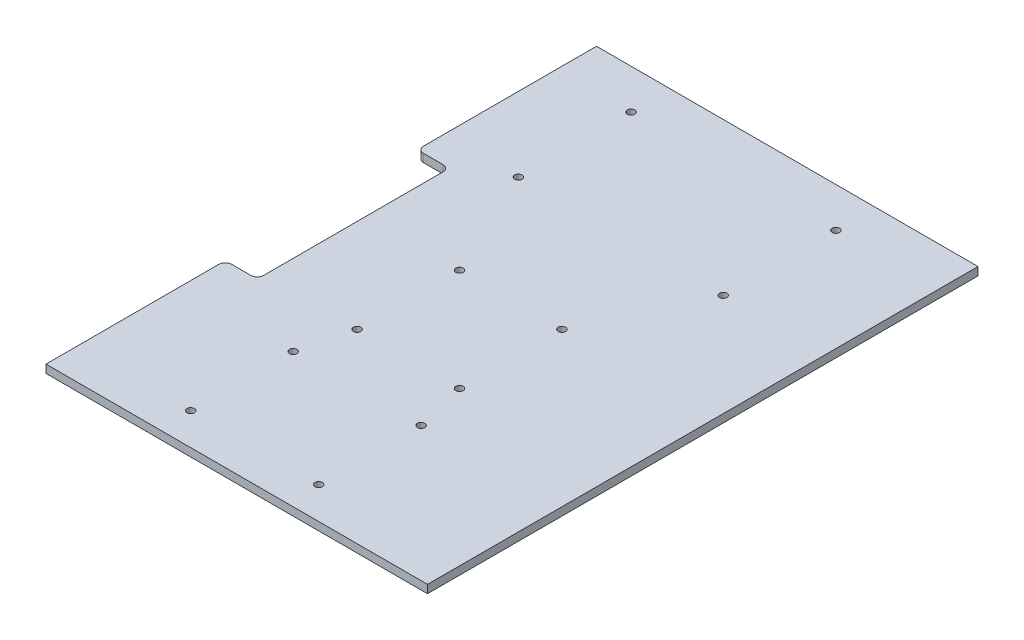
ISO-10303-21;
HEADER;
FILE_DESCRIPTION(('STEP AP214'),'2;1');
FILE_NAME('part.step','',(''),(''),'','','');
FILE_SCHEMA(('AUTOMOTIVE_DESIGN { 1 0 10303 214 1 1 1 1 }'));
ENDSEC;
DATA;
#1=APPLICATION_CONTEXT('core data for automotive mechanical design processes');
#2=APPLICATION_PROTOCOL_DEFINITION('international standard','automotive_design',2000,#1);
#3=PRODUCT_CONTEXT('',#1,'mechanical');
#4=PRODUCT('Part','Part','',(#3));
#5=PRODUCT_RELATED_PRODUCT_CATEGORY('part','',(#4));
#6=PRODUCT_DEFINITION_FORMATION('','',#4);
#7=PRODUCT_DEFINITION_CONTEXT('part definition',#1,'design');
#8=PRODUCT_DEFINITION('design','',#6,#7);
#9=PRODUCT_DEFINITION_SHAPE('','',#8);
#10=(LENGTH_UNIT() NAMED_UNIT(*) SI_UNIT(.MILLI.,.METRE.));
#11=(NAMED_UNIT(*) PLANE_ANGLE_UNIT() SI_UNIT($,.RADIAN.));
#12=(NAMED_UNIT(*) SI_UNIT($,.STERADIAN.) SOLID_ANGLE_UNIT());
#13=UNCERTAINTY_MEASURE_WITH_UNIT(LENGTH_MEASURE(1.E-05),#10,'distance_accuracy_value','');
#14=(GEOMETRIC_REPRESENTATION_CONTEXT(3) GLOBAL_UNCERTAINTY_ASSIGNED_CONTEXT((#13)) GLOBAL_UNIT_ASSIGNED_CONTEXT((#10,
#11,#12)) REPRESENTATION_CONTEXT('',''));
#15=CARTESIAN_POINT('',(0.,0.,0.));
#16=DIRECTION('',(0.,0.,1.));
#17=DIRECTION('',(1.,0.,0.));
#18=AXIS2_PLACEMENT_3D('',#15,#16,#17);
#19=CARTESIAN_POINT('',(-160.,0.,-215.));
#20=DIRECTION('',(0.,0.,1.));
#21=DIRECTION('',(-1.,0.,0.));
#22=AXIS2_PLACEMENT_3D('',#19,#20,#21);
#23=PLANE('',#22);
#24=DIRECTION('',(0.,1.,0.));
#25=VECTOR('',#24,1.);
#26=CARTESIAN_POINT('',(-138.,0.,-215.));
#27=LINE('',#26,#25);
#28=CARTESIAN_POINT('',(-138.,0.,-215.));
#29=VERTEX_POINT('',#28);
#30=CARTESIAN_POINT('',(-138.,6.35,-215.));
#31=VERTEX_POINT('',#30);
#32=EDGE_CURVE('E144',#29,#31,#27,.T.);
#33=ORIENTED_EDGE('',*,*,#32,.T.);
#34=DIRECTION('',(1.,0.,0.));
#35=VECTOR('',#34,1.);
#36=CARTESIAN_POINT('',(0.,6.35,-215.));
#37=LINE('',#36,#35);
#38=CARTESIAN_POINT('',(160.,6.35,-215.));
#39=VERTEX_POINT('',#38);
#40=EDGE_CURVE('E158',#39,#31,#37,.F.);
#41=ORIENTED_EDGE('',*,*,#40,.F.);
#42=DIRECTION('',(0.,-1.,0.));
#43=VECTOR('',#42,1.);
#44=CARTESIAN_POINT('',(160.,0.,-215.));
#45=LINE('',#44,#43);
#46=CARTESIAN_POINT('',(160.,0.,-215.));
#47=VERTEX_POINT('',#46);
#48=EDGE_CURVE('E167',#39,#47,#45,.T.);
#49=ORIENTED_EDGE('',*,*,#48,.T.);
#50=DIRECTION('',(-1.,0.,0.));
#51=VECTOR('',#50,1.);
#52=CARTESIAN_POINT('',(-160.,0.,-215.));
#53=LINE('',#52,#51);
#54=EDGE_CURVE('E153',#47,#29,#53,.T.);
#55=ORIENTED_EDGE('',*,*,#54,.T.);
#56=EDGE_LOOP('',(#33,#41,#49,#55));
#57=FACE_BOUND('',#56,.T.);
#58=ADVANCED_FACE('F36',(#57),#23,.F.);
#59=CARTESIAN_POINT('',(160.,0.,215.));
#60=DIRECTION('',(-1.,0.,0.));
#61=DIRECTION('',(0.,0.,-1.));
#62=AXIS2_PLACEMENT_3D('',#59,#60,#61);
#63=PLANE('',#62);
#64=ORIENTED_EDGE('',*,*,#48,.F.);
#65=DIRECTION('',(0.,0.,-1.));
#66=VECTOR('',#65,1.);
#67=CARTESIAN_POINT('',(160.,6.35,0.));
#68=LINE('',#67,#66);
#69=CARTESIAN_POINT('',(160.,6.35,215.));
#70=VERTEX_POINT('',#69);
#71=EDGE_CURVE('E161',#70,#39,#68,.T.);
#72=ORIENTED_EDGE('',*,*,#71,.F.);
#73=DIRECTION('',(0.,-1.,0.));
#74=VECTOR('',#73,1.);
#75=CARTESIAN_POINT('',(160.,0.,215.));
#76=LINE('',#75,#74);
#77=CARTESIAN_POINT('',(160.,0.,215.));
#78=VERTEX_POINT('',#77);
#79=EDGE_CURVE('E156',#70,#78,#76,.T.);
#80=ORIENTED_EDGE('',*,*,#79,.T.);
#81=DIRECTION('',(0.,0.,-1.));
#82=VECTOR('',#81,1.);
#83=CARTESIAN_POINT('',(160.,0.,215.));
#84=LINE('',#83,#82);
#85=EDGE_CURVE('E152',#78,#47,#84,.T.);
#86=ORIENTED_EDGE('',*,*,#85,.T.);
#87=EDGE_LOOP('',(#64,#72,#80,#86));
#88=FACE_BOUND('',#87,.T.);
#89=ADVANCED_FACE('F241',(#88),#63,.F.);
#90=CARTESIAN_POINT('',(-160.,0.,215.));
#91=DIRECTION('',(0.,0.,-1.));
#92=DIRECTION('',(1.,0.,0.));
#93=AXIS2_PLACEMENT_3D('',#90,#91,#92);
#94=PLANE('',#93);
#95=DIRECTION('',(0.,1.,0.));
#96=VECTOR('',#95,1.);
#97=CARTESIAN_POINT('',(-138.,0.,215.));
#98=LINE('',#97,#96);
#99=CARTESIAN_POINT('',(-138.,0.,215.));
#100=VERTEX_POINT('',#99);
#101=CARTESIAN_POINT('',(-138.,6.35,215.));
#102=VERTEX_POINT('',#101);
#103=EDGE_CURVE('E128',#100,#102,#98,.T.);
#104=ORIENTED_EDGE('',*,*,#103,.F.);
#105=DIRECTION('',(1.,0.,0.));
#106=VECTOR('',#105,1.);
#107=CARTESIAN_POINT('',(-160.,0.,215.));
#108=LINE('',#107,#106);
#109=EDGE_CURVE('E141',#100,#78,#108,.T.);
#110=ORIENTED_EDGE('',*,*,#109,.T.);
#111=ORIENTED_EDGE('',*,*,#79,.F.);
#112=DIRECTION('',(1.,0.,0.));
#113=VECTOR('',#112,1.);
#114=CARTESIAN_POINT('',(0.,6.35,215.));
#115=LINE('',#114,#113);
#116=EDGE_CURVE('E143',#102,#70,#115,.T.);
#117=ORIENTED_EDGE('',*,*,#116,.F.);
#118=EDGE_LOOP('',(#104,#110,#111,#117));
#119=FACE_BOUND('',#118,.T.);
#120=ADVANCED_FACE('F139',(#119),#94,.F.);
#121=CARTESIAN_POINT('',(0.,0.,0.));
#122=DIRECTION('',(0.,-1.,0.));
#123=DIRECTION('',(0.,0.,-1.));
#124=AXIS2_PLACEMENT_3D('',#121,#122,#123);
#125=PLANE('',#124);
#126=CARTESIAN_POINT('',(-79.9999999999998,0.,-95.9999999999997));
#127=DIRECTION('',(0.,1.,0.));
#128=DIRECTION('',(0.,0.,1.));
#129=AXIS2_PLACEMENT_3D('',#126,#127,#128);
#130=CIRCLE('',#129,2.9);
#131=CARTESIAN_POINT('',(-79.9999999999998,0.,-93.0999999999997));
#132=VERTEX_POINT('',#131);
#133=EDGE_CURVE('E344',#132,#132,#130,.T.);
#134=ORIENTED_EDGE('',*,*,#133,.T.);
#135=EDGE_LOOP('',(#134));
#136=FACE_BOUND('',#135,.T.);
#137=CARTESIAN_POINT('',(-80.0000000000002,0.,-184.));
#138=DIRECTION('',(0.,1.,0.));
#139=DIRECTION('',(0.,0.,1.));
#140=AXIS2_PLACEMENT_3D('',#137,#138,#139);
#141=CIRCLE('',#140,2.9);
#142=CARTESIAN_POINT('',(-80.0000000000002,0.,-181.1));
#143=VERTEX_POINT('',#142);
#144=EDGE_CURVE('E354',#143,#143,#141,.T.);
#145=ORIENTED_EDGE('',*,*,#144,.T.);
#146=EDGE_LOOP('',(#145));
#147=FACE_BOUND('',#146,.T.);
#148=CARTESIAN_POINT('',(79.9999999999998,0.,-184.));
#149=DIRECTION('',(0.,1.,0.));
#150=DIRECTION('',(0.,0.,1.));
#151=AXIS2_PLACEMENT_3D('',#148,#149,#150);
#152=CIRCLE('',#151,2.9);
#153=CARTESIAN_POINT('',(79.9999999999998,0.,-181.1));
#154=VERTEX_POINT('',#153);
#155=EDGE_CURVE('E360',#154,#154,#152,.T.);
#156=ORIENTED_EDGE('',*,*,#155,.T.);
#157=EDGE_LOOP('',(#156));
#158=FACE_BOUND('',#157,.T.);
#159=CARTESIAN_POINT('',(80.0000000000002,0.,-96.0000000000003));
#160=DIRECTION('',(0.,1.,0.));
#161=DIRECTION('',(0.,0.,1.));
#162=AXIS2_PLACEMENT_3D('',#159,#160,#161);
#163=CIRCLE('',#162,2.9);
#164=CARTESIAN_POINT('',(80.0000000000002,0.,-93.1000000000003));
#165=VERTEX_POINT('',#164);
#166=EDGE_CURVE('E366',#165,#165,#163,.T.);
#167=ORIENTED_EDGE('',*,*,#166,.T.);
#168=EDGE_LOOP('',(#167));
#169=FACE_BOUND('',#168,.T.);
#170=CARTESIAN_POINT('',(-40.,0.,70.));
#171=DIRECTION('',(0.,1.,0.));
#172=DIRECTION('',(0.,0.,1.));
#173=AXIS2_PLACEMENT_3D('',#170,#171,#172);
#174=CIRCLE('',#173,2.9);
#175=CARTESIAN_POINT('',(-40.,0.,72.9));
#176=VERTEX_POINT('',#175);
#177=EDGE_CURVE('E372',#176,#176,#174,.T.);
#178=ORIENTED_EDGE('',*,*,#177,.T.);
#179=EDGE_LOOP('',(#178));
#180=FACE_BOUND('',#179,.T.);
#181=CARTESIAN_POINT('',(40.,0.,70.));
#182=DIRECTION('',(0.,1.,0.));
#183=DIRECTION('',(0.,0.,1.));
#184=AXIS2_PLACEMENT_3D('',#181,#182,#183);
#185=CIRCLE('',#184,2.9);
#186=CARTESIAN_POINT('',(40.,0.,72.9));
#187=VERTEX_POINT('',#186);
#188=EDGE_CURVE('E378',#187,#187,#185,.T.);
#189=ORIENTED_EDGE('',*,*,#188,.T.);
#190=EDGE_LOOP('',(#189));
#191=FACE_BOUND('',#190,.T.);
#192=CARTESIAN_POINT('',(40.,0.,-9.99999999999999));
#193=DIRECTION('',(0.,1.,0.));
#194=DIRECTION('',(0.,0.,1.));
#195=AXIS2_PLACEMENT_3D('',#192,#193,#194);
#196=CIRCLE('',#195,2.9);
#197=CARTESIAN_POINT('',(40.,0.,-7.09999999999999));
#198=VERTEX_POINT('',#197);
#199=EDGE_CURVE('E384',#198,#198,#196,.T.);
#200=ORIENTED_EDGE('',*,*,#199,.T.);
#201=EDGE_LOOP('',(#200));
#202=FACE_BOUND('',#201,.T.);
#203=CARTESIAN_POINT('',(-40.,0.,-9.99999999999999));
#204=DIRECTION('',(0.,1.,0.));
#205=DIRECTION('',(0.,0.,1.));
#206=AXIS2_PLACEMENT_3D('',#203,#204,#205);
#207=CIRCLE('',#206,2.9);
#208=CARTESIAN_POINT('',(-40.,0.,-7.09999999999999));
#209=VERTEX_POINT('',#208);
#210=EDGE_CURVE('E390',#209,#209,#207,.T.);
#211=ORIENTED_EDGE('',*,*,#210,.T.);
#212=EDGE_LOOP('',(#211));
#213=FACE_BOUND('',#212,.T.);
#214=CARTESIAN_POINT('',(-50.,0.,110.));
#215=DIRECTION('',(0.,1.,0.));
#216=DIRECTION('',(0.,0.,1.));
#217=AXIS2_PLACEMENT_3D('',#214,#215,#216);
#218=CIRCLE('',#217,2.9);
#219=CARTESIAN_POINT('',(-50.,0.,112.9));
#220=VERTEX_POINT('',#219);
#221=EDGE_CURVE('E396',#220,#220,#218,.T.);
#222=ORIENTED_EDGE('',*,*,#221,.T.);
#223=EDGE_LOOP('',(#222));
#224=FACE_BOUND('',#223,.T.);
#225=CARTESIAN_POINT('',(-50.,0.,190.));
#226=DIRECTION('',(0.,1.,0.));
#227=DIRECTION('',(0.,0.,1.));
#228=AXIS2_PLACEMENT_3D('',#225,#226,#227);
#229=CIRCLE('',#228,2.9);
#230=CARTESIAN_POINT('',(-50.,0.,192.9));
#231=VERTEX_POINT('',#230);
#232=EDGE_CURVE('E402',#231,#231,#229,.T.);
#233=ORIENTED_EDGE('',*,*,#232,.T.);
#234=EDGE_LOOP('',(#233));
#235=FACE_BOUND('',#234,.T.);
#236=CARTESIAN_POINT('',(50.,0.,190.));
#237=DIRECTION('',(0.,1.,0.));
#238=DIRECTION('',(0.,0.,1.));
#239=AXIS2_PLACEMENT_3D('',#236,#237,#238);
#240=CIRCLE('',#239,2.9);
#241=CARTESIAN_POINT('',(50.,0.,192.9));
#242=VERTEX_POINT('',#241);
#243=EDGE_CURVE('E408',#242,#242,#240,.T.);
#244=ORIENTED_EDGE('',*,*,#243,.T.);
#245=EDGE_LOOP('',(#244));
#246=FACE_BOUND('',#245,.T.);
#247=CARTESIAN_POINT('',(50.,0.,110.));
#248=DIRECTION('',(0.,1.,0.));
#249=DIRECTION('',(0.,0.,1.));
#250=AXIS2_PLACEMENT_3D('',#247,#248,#249);
#251=CIRCLE('',#250,2.9);
#252=CARTESIAN_POINT('',(50.,0.,112.9));
#253=VERTEX_POINT('',#252);
#254=EDGE_CURVE('E226',#253,#253,#251,.T.);
#255=ORIENTED_EDGE('',*,*,#254,.T.);
#256=EDGE_LOOP('',(#255));
#257=FACE_BOUND('',#256,.T.);
#258=DIRECTION('',(-1.,0.,0.));
#259=VECTOR('',#258,1.);
#260=CARTESIAN_POINT('',(-138.,0.,-75.));
#261=LINE('',#260,#259);
#262=CARTESIAN_POINT('',(-118.,0.,-75.));
#263=VERTEX_POINT('',#262);
#264=CARTESIAN_POINT('',(-133.,0.,-75.));
#265=VERTEX_POINT('',#264);
#266=EDGE_CURVE('E220',#263,#265,#261,.T.);
#267=ORIENTED_EDGE('',*,*,#266,.T.);
#268=CARTESIAN_POINT('',(-133.,0.,-80.));
#269=DIRECTION('',(0.,-1.,0.));
#270=DIRECTION('',(0.,0.,-1.));
#271=AXIS2_PLACEMENT_3D('',#268,#269,#270);
#272=CIRCLE('',#271,5.);
#273=CARTESIAN_POINT('',(-138.,0.,-80.));
#274=VERTEX_POINT('',#273);
#275=EDGE_CURVE('E184',#265,#274,#272,.T.);
#276=ORIENTED_EDGE('',*,*,#275,.T.);
#277=DIRECTION('',(0.,0.,-1.));
#278=VECTOR('',#277,1.);
#279=CARTESIAN_POINT('',(-138.,0.,-215.));
#280=LINE('',#279,#278);
#281=EDGE_CURVE('E145',#274,#29,#280,.T.);
#282=ORIENTED_EDGE('',*,*,#281,.T.);
#283=ORIENTED_EDGE('',*,*,#54,.F.);
#284=ORIENTED_EDGE('',*,*,#85,.F.);
#285=ORIENTED_EDGE('',*,*,#109,.F.);
#286=DIRECTION('',(0.,0.,-1.));
#287=VECTOR('',#286,1.);
#288=CARTESIAN_POINT('',(-138.,0.,75.));
#289=LINE('',#288,#287);
#290=CARTESIAN_POINT('',(-138.,0.,80.));
#291=VERTEX_POINT('',#290);
#292=EDGE_CURVE('E124',#100,#291,#289,.T.);
#293=ORIENTED_EDGE('',*,*,#292,.T.);
#294=CARTESIAN_POINT('',(-133.,0.,80.));
#295=DIRECTION('',(0.,-1.,0.));
#296=DIRECTION('',(0.,0.,-1.));
#297=AXIS2_PLACEMENT_3D('',#294,#295,#296);
#298=CIRCLE('',#297,5.);
#299=CARTESIAN_POINT('',(-133.,0.,75.));
#300=VERTEX_POINT('',#299);
#301=EDGE_CURVE('E182',#291,#300,#298,.T.);
#302=ORIENTED_EDGE('',*,*,#301,.T.);
#303=DIRECTION('',(1.,0.,0.));
#304=VECTOR('',#303,1.);
#305=CARTESIAN_POINT('',(-113.,0.,75.));
#306=LINE('',#305,#304);
#307=CARTESIAN_POINT('',(-118.,0.,75.));
#308=VERTEX_POINT('',#307);
#309=EDGE_CURVE('E134',#300,#308,#306,.T.);
#310=ORIENTED_EDGE('',*,*,#309,.T.);
#311=CARTESIAN_POINT('',(-118.,0.,70.));
#312=DIRECTION('',(0.,-1.,0.));
#313=DIRECTION('',(0.,0.,-1.));
#314=AXIS2_PLACEMENT_3D('',#311,#312,#313);
#315=CIRCLE('',#314,5.);
#316=CARTESIAN_POINT('',(-113.,0.,70.));
#317=VERTEX_POINT('',#316);
#318=EDGE_CURVE('E11',#308,#317,#315,.F.);
#319=ORIENTED_EDGE('',*,*,#318,.T.);
#320=DIRECTION('',(0.,0.,-1.));
#321=VECTOR('',#320,1.);
#322=CARTESIAN_POINT('',(-113.,0.,-75.));
#323=LINE('',#322,#321);
#324=CARTESIAN_POINT('',(-113.,0.,-70.));
#325=VERTEX_POINT('',#324);
#326=EDGE_CURVE('E218',#317,#325,#323,.T.);
#327=ORIENTED_EDGE('',*,*,#326,.T.);
#328=CARTESIAN_POINT('',(-118.,0.,-70.));
#329=DIRECTION('',(0.,-1.,0.));
#330=DIRECTION('',(0.,0.,-1.));
#331=AXIS2_PLACEMENT_3D('',#328,#329,#330);
#332=CIRCLE('',#331,5.);
#333=EDGE_CURVE('E198',#325,#263,#332,.F.);
#334=ORIENTED_EDGE('',*,*,#333,.T.);
#335=EDGE_LOOP('',(#267,#276,#282,#283,#284,#285,#293,#302,#310,#319,#327,#334));
#336=FACE_BOUND('',#335,.T.);
#337=ADVANCED_FACE('F149',(#136,#147,#158,#169,#180,#191,#202,#213,#224,#235,#246,#257,#336),
#125,.T.);
#338=CARTESIAN_POINT('',(0.,6.35,0.));
#339=DIRECTION('',(0.,-1.,0.));
#340=DIRECTION('',(0.,0.,-1.));
#341=AXIS2_PLACEMENT_3D('',#338,#339,#340);
#342=PLANE('',#341);
#343=CARTESIAN_POINT('',(-79.9999999999998,6.35,-95.9999999999997));
#344=DIRECTION('',(0.,1.,0.));
#345=DIRECTION('',(0.,0.,1.));
#346=AXIS2_PLACEMENT_3D('',#343,#344,#345);
#347=CIRCLE('',#346,2.89999999999999);
#348=CARTESIAN_POINT('',(-79.9999999999998,6.35,-93.0999999999997));
#349=VERTEX_POINT('',#348);
#350=EDGE_CURVE('E347',#349,#349,#347,.T.);
#351=ORIENTED_EDGE('',*,*,#350,.F.);
#352=EDGE_LOOP('',(#351));
#353=FACE_BOUND('',#352,.T.);
#354=CARTESIAN_POINT('',(-80.0000000000002,6.35,-184.));
#355=DIRECTION('',(0.,1.,0.));
#356=DIRECTION('',(0.,0.,1.));
#357=AXIS2_PLACEMENT_3D('',#354,#355,#356);
#358=CIRCLE('',#357,2.89999999999999);
#359=CARTESIAN_POINT('',(-80.0000000000002,6.35,-181.1));
#360=VERTEX_POINT('',#359);
#361=EDGE_CURVE('E349',#360,#360,#358,.T.);
#362=ORIENTED_EDGE('',*,*,#361,.F.);
#363=EDGE_LOOP('',(#362));
#364=FACE_BOUND('',#363,.T.);
#365=CARTESIAN_POINT('',(79.9999999999998,6.35,-184.));
#366=DIRECTION('',(0.,1.,0.));
#367=DIRECTION('',(0.,0.,1.));
#368=AXIS2_PLACEMENT_3D('',#365,#366,#367);
#369=CIRCLE('',#368,2.89999999999999);
#370=CARTESIAN_POINT('',(79.9999999999998,6.35,-181.1));
#371=VERTEX_POINT('',#370);
#372=EDGE_CURVE('E357',#371,#371,#369,.T.);
#373=ORIENTED_EDGE('',*,*,#372,.F.);
#374=EDGE_LOOP('',(#373));
#375=FACE_BOUND('',#374,.T.);
#376=CARTESIAN_POINT('',(80.0000000000002,6.35,-96.0000000000003));
#377=DIRECTION('',(0.,1.,0.));
#378=DIRECTION('',(0.,0.,1.));
#379=AXIS2_PLACEMENT_3D('',#376,#377,#378);
#380=CIRCLE('',#379,2.89999999999999);
#381=CARTESIAN_POINT('',(80.0000000000002,6.35,-93.1000000000003));
#382=VERTEX_POINT('',#381);
#383=EDGE_CURVE('E363',#382,#382,#380,.T.);
#384=ORIENTED_EDGE('',*,*,#383,.F.);
#385=EDGE_LOOP('',(#384));
#386=FACE_BOUND('',#385,.T.);
#387=CARTESIAN_POINT('',(-40.,6.35,70.));
#388=DIRECTION('',(0.,1.,0.));
#389=DIRECTION('',(0.,0.,1.));
#390=AXIS2_PLACEMENT_3D('',#387,#388,#389);
#391=CIRCLE('',#390,2.89999999999999);
#392=CARTESIAN_POINT('',(-40.,6.35,72.9));
#393=VERTEX_POINT('',#392);
#394=EDGE_CURVE('E369',#393,#393,#391,.T.);
#395=ORIENTED_EDGE('',*,*,#394,.F.);
#396=EDGE_LOOP('',(#395));
#397=FACE_BOUND('',#396,.T.);
#398=CARTESIAN_POINT('',(40.,6.35,70.));
#399=DIRECTION('',(0.,1.,0.));
#400=DIRECTION('',(0.,0.,1.));
#401=AXIS2_PLACEMENT_3D('',#398,#399,#400);
#402=CIRCLE('',#401,2.89999999999999);
#403=CARTESIAN_POINT('',(40.,6.35,72.9));
#404=VERTEX_POINT('',#403);
#405=EDGE_CURVE('E375',#404,#404,#402,.T.);
#406=ORIENTED_EDGE('',*,*,#405,.F.);
#407=EDGE_LOOP('',(#406));
#408=FACE_BOUND('',#407,.T.);
#409=CARTESIAN_POINT('',(40.,6.35,-9.99999999999999));
#410=DIRECTION('',(0.,1.,0.));
#411=DIRECTION('',(0.,0.,1.));
#412=AXIS2_PLACEMENT_3D('',#409,#410,#411);
#413=CIRCLE('',#412,2.89999999999999);
#414=CARTESIAN_POINT('',(40.,6.35,-7.1));
#415=VERTEX_POINT('',#414);
#416=EDGE_CURVE('E381',#415,#415,#413,.T.);
#417=ORIENTED_EDGE('',*,*,#416,.F.);
#418=EDGE_LOOP('',(#417));
#419=FACE_BOUND('',#418,.T.);
#420=CARTESIAN_POINT('',(-40.,6.35,-9.99999999999999));
#421=DIRECTION('',(0.,1.,0.));
#422=DIRECTION('',(0.,0.,1.));
#423=AXIS2_PLACEMENT_3D('',#420,#421,#422);
#424=CIRCLE('',#423,2.89999999999999);
#425=CARTESIAN_POINT('',(-40.,6.35,-7.1));
#426=VERTEX_POINT('',#425);
#427=EDGE_CURVE('E387',#426,#426,#424,.T.);
#428=ORIENTED_EDGE('',*,*,#427,.F.);
#429=EDGE_LOOP('',(#428));
#430=FACE_BOUND('',#429,.T.);
#431=CARTESIAN_POINT('',(-50.,6.35,110.));
#432=DIRECTION('',(0.,1.,0.));
#433=DIRECTION('',(0.,0.,1.));
#434=AXIS2_PLACEMENT_3D('',#431,#432,#433);
#435=CIRCLE('',#434,2.9);
#436=CARTESIAN_POINT('',(-50.,6.35,112.9));
#437=VERTEX_POINT('',#436);
#438=EDGE_CURVE('E393',#437,#437,#435,.T.);
#439=ORIENTED_EDGE('',*,*,#438,.F.);
#440=EDGE_LOOP('',(#439));
#441=FACE_BOUND('',#440,.T.);
#442=CARTESIAN_POINT('',(-50.,6.35,190.));
#443=DIRECTION('',(0.,1.,0.));
#444=DIRECTION('',(0.,0.,1.));
#445=AXIS2_PLACEMENT_3D('',#442,#443,#444);
#446=CIRCLE('',#445,2.9);
#447=CARTESIAN_POINT('',(-50.,6.35,192.9));
#448=VERTEX_POINT('',#447);
#449=EDGE_CURVE('E399',#448,#448,#446,.T.);
#450=ORIENTED_EDGE('',*,*,#449,.F.);
#451=EDGE_LOOP('',(#450));
#452=FACE_BOUND('',#451,.T.);
#453=CARTESIAN_POINT('',(50.,6.35,190.));
#454=DIRECTION('',(0.,1.,0.));
#455=DIRECTION('',(0.,0.,1.));
#456=AXIS2_PLACEMENT_3D('',#453,#454,#455);
#457=CIRCLE('',#456,2.9);
#458=CARTESIAN_POINT('',(50.,6.35,192.9));
#459=VERTEX_POINT('',#458);
#460=EDGE_CURVE('E405',#459,#459,#457,.T.);
#461=ORIENTED_EDGE('',*,*,#460,.F.);
#462=EDGE_LOOP('',(#461));
#463=FACE_BOUND('',#462,.T.);
#464=CARTESIAN_POINT('',(50.,6.35,110.));
#465=DIRECTION('',(0.,1.,0.));
#466=DIRECTION('',(0.,0.,1.));
#467=AXIS2_PLACEMENT_3D('',#464,#465,#466);
#468=CIRCLE('',#467,2.9);
#469=CARTESIAN_POINT('',(50.,6.35,112.9));
#470=VERTEX_POINT('',#469);
#471=EDGE_CURVE('E411',#470,#470,#468,.T.);
#472=ORIENTED_EDGE('',*,*,#471,.F.);
#473=EDGE_LOOP('',(#472));
#474=FACE_BOUND('',#473,.T.);
#475=DIRECTION('',(0.,0.,-1.));
#476=VECTOR('',#475,1.);
#477=CARTESIAN_POINT('',(-138.,6.35,-215.));
#478=LINE('',#477,#476);
#479=CARTESIAN_POINT('',(-138.,6.35,-80.));
#480=VERTEX_POINT('',#479);
#481=EDGE_CURVE('E135',#480,#31,#478,.T.);
#482=ORIENTED_EDGE('',*,*,#481,.F.);
#483=CARTESIAN_POINT('',(-133.,6.35,-80.));
#484=DIRECTION('',(0.,-1.,0.));
#485=DIRECTION('',(0.,0.,-1.));
#486=AXIS2_PLACEMENT_3D('',#483,#484,#485);
#487=CIRCLE('',#486,5.);
#488=CARTESIAN_POINT('',(-133.,6.35,-75.));
#489=VERTEX_POINT('',#488);
#490=EDGE_CURVE('E175',#480,#489,#487,.F.);
#491=ORIENTED_EDGE('',*,*,#490,.T.);
#492=DIRECTION('',(-1.,0.,0.));
#493=VECTOR('',#492,1.);
#494=CARTESIAN_POINT('',(-138.,6.35,-75.));
#495=LINE('',#494,#493);
#496=CARTESIAN_POINT('',(-118.,6.35,-75.));
#497=VERTEX_POINT('',#496);
#498=EDGE_CURVE('E229',#497,#489,#495,.T.);
#499=ORIENTED_EDGE('',*,*,#498,.F.);
#500=CARTESIAN_POINT('',(-118.,6.35,-70.));
#501=DIRECTION('',(0.,-1.,0.));
#502=DIRECTION('',(0.,0.,-1.));
#503=AXIS2_PLACEMENT_3D('',#500,#501,#502);
#504=CIRCLE('',#503,5.);
#505=CARTESIAN_POINT('',(-113.,6.35,-70.));
#506=VERTEX_POINT('',#505);
#507=EDGE_CURVE('E196',#497,#506,#504,.T.);
#508=ORIENTED_EDGE('',*,*,#507,.T.);
#509=DIRECTION('',(0.,0.,-1.));
#510=VECTOR('',#509,1.);
#511=CARTESIAN_POINT('',(-113.,6.35,-75.));
#512=LINE('',#511,#510);
#513=CARTESIAN_POINT('',(-113.,6.35,70.));
#514=VERTEX_POINT('',#513);
#515=EDGE_CURVE('E206',#514,#506,#512,.T.);
#516=ORIENTED_EDGE('',*,*,#515,.F.);
#517=CARTESIAN_POINT('',(-118.,6.35,70.));
#518=DIRECTION('',(0.,-1.,0.));
#519=DIRECTION('',(0.,0.,-1.));
#520=AXIS2_PLACEMENT_3D('',#517,#518,#519);
#521=CIRCLE('',#520,5.);
#522=CARTESIAN_POINT('',(-118.,6.35,75.));
#523=VERTEX_POINT('',#522);
#524=EDGE_CURVE('E44',#514,#523,#521,.T.);
#525=ORIENTED_EDGE('',*,*,#524,.T.);
#526=DIRECTION('',(1.,0.,0.));
#527=VECTOR('',#526,1.);
#528=CARTESIAN_POINT('',(-113.,6.35,75.));
#529=LINE('',#528,#527);
#530=CARTESIAN_POINT('',(-133.,6.35,75.));
#531=VERTEX_POINT('',#530);
#532=EDGE_CURVE('E205',#531,#523,#529,.T.);
#533=ORIENTED_EDGE('',*,*,#532,.F.);
#534=CARTESIAN_POINT('',(-133.,6.35,80.));
#535=DIRECTION('',(0.,-1.,0.));
#536=DIRECTION('',(0.,0.,-1.));
#537=AXIS2_PLACEMENT_3D('',#534,#535,#536);
#538=CIRCLE('',#537,5.);
#539=CARTESIAN_POINT('',(-138.,6.35,80.));
#540=VERTEX_POINT('',#539);
#541=EDGE_CURVE('E173',#531,#540,#538,.F.);
#542=ORIENTED_EDGE('',*,*,#541,.T.);
#543=DIRECTION('',(0.,0.,-1.));
#544=VECTOR('',#543,1.);
#545=CARTESIAN_POINT('',(-138.,6.35,75.));
#546=LINE('',#545,#544);
#547=EDGE_CURVE('E214',#102,#540,#546,.T.);
#548=ORIENTED_EDGE('',*,*,#547,.F.);
#549=ORIENTED_EDGE('',*,*,#116,.T.);
#550=ORIENTED_EDGE('',*,*,#71,.T.);
#551=ORIENTED_EDGE('',*,*,#40,.T.);
#552=EDGE_LOOP('',(#482,#491,#499,#508,#516,#525,#533,#542,#548,#549,#550,#551));
#553=FACE_BOUND('',#552,.T.);
#554=ADVANCED_FACE('F204',(#353,#364,#375,#386,#397,#408,#419,#430,#441,#452,#463,#474,#553),
#342,.F.);
#555=CARTESIAN_POINT('',(-138.,0.,-215.));
#556=DIRECTION('',(1.,0.,0.));
#557=DIRECTION('',(0.,0.,-1.));
#558=AXIS2_PLACEMENT_3D('',#555,#556,#557);
#559=PLANE('',#558);
#560=ORIENTED_EDGE('',*,*,#281,.F.);
#561=DIRECTION('',(0.,1.,0.));
#562=VECTOR('',#561,1.);
#563=CARTESIAN_POINT('',(-138.,0.,-80.));
#564=LINE('',#563,#562);
#565=EDGE_CURVE('E169',#274,#480,#564,.T.);
#566=ORIENTED_EDGE('',*,*,#565,.T.);
#567=ORIENTED_EDGE('',*,*,#481,.T.);
#568=ORIENTED_EDGE('',*,*,#32,.F.);
#569=EDGE_LOOP('',(#560,#566,#567,#568));
#570=FACE_BOUND('',#569,.T.);
#571=ADVANCED_FACE('F244',(#570),#559,.F.);
#572=CARTESIAN_POINT('',(-138.,0.,-75.));
#573=DIRECTION('',(0.,0.,-1.));
#574=DIRECTION('',(-1.,0.,0.));
#575=AXIS2_PLACEMENT_3D('',#572,#573,#574);
#576=PLANE('',#575);
#577=ORIENTED_EDGE('',*,*,#498,.T.);
#578=DIRECTION('',(0.,1.,0.));
#579=VECTOR('',#578,1.);
#580=CARTESIAN_POINT('',(-133.,0.,-75.));
#581=LINE('',#580,#579);
#582=EDGE_CURVE('E180',#489,#265,#581,.F.);
#583=ORIENTED_EDGE('',*,*,#582,.T.);
#584=ORIENTED_EDGE('',*,*,#266,.F.);
#585=DIRECTION('',(0.,1.,0.));
#586=VECTOR('',#585,1.);
#587=CARTESIAN_POINT('',(-118.,6.35,-75.));
#588=LINE('',#587,#586);
#589=EDGE_CURVE('E177',#263,#497,#588,.T.);
#590=ORIENTED_EDGE('',*,*,#589,.T.);
#591=EDGE_LOOP('',(#577,#583,#584,#590));
#592=FACE_BOUND('',#591,.T.);
#593=ADVANCED_FACE('F250',(#592),#576,.F.);
#594=CARTESIAN_POINT('',(-113.,0.,-75.));
#595=DIRECTION('',(1.,0.,0.));
#596=DIRECTION('',(0.,0.,-1.));
#597=AXIS2_PLACEMENT_3D('',#594,#595,#596);
#598=PLANE('',#597);
#599=ORIENTED_EDGE('',*,*,#515,.T.);
#600=DIRECTION('',(0.,1.,0.));
#601=VECTOR('',#600,1.);
#602=CARTESIAN_POINT('',(-113.,0.,-70.));
#603=LINE('',#602,#601);
#604=EDGE_CURVE('E51',#506,#325,#603,.F.);
#605=ORIENTED_EDGE('',*,*,#604,.T.);
#606=ORIENTED_EDGE('',*,*,#326,.F.);
#607=DIRECTION('',(0.,1.,0.));
#608=VECTOR('',#607,1.);
#609=CARTESIAN_POINT('',(-113.,6.35,70.));
#610=LINE('',#609,#608);
#611=EDGE_CURVE('E186',#317,#514,#610,.T.);
#612=ORIENTED_EDGE('',*,*,#611,.T.);
#613=EDGE_LOOP('',(#599,#605,#606,#612));
#614=FACE_BOUND('',#613,.T.);
#615=ADVANCED_FACE('F217',(#614),#598,.F.);
#616=CARTESIAN_POINT('',(-113.,0.,75.));
#617=DIRECTION('',(0.,0.,1.));
#618=DIRECTION('',(1.,0.,0.));
#619=AXIS2_PLACEMENT_3D('',#616,#617,#618);
#620=PLANE('',#619);
#621=ORIENTED_EDGE('',*,*,#532,.T.);
#622=DIRECTION('',(0.,1.,0.));
#623=VECTOR('',#622,1.);
#624=CARTESIAN_POINT('',(-118.,0.,75.));
#625=LINE('',#624,#623);
#626=EDGE_CURVE('E193',#523,#308,#625,.F.);
#627=ORIENTED_EDGE('',*,*,#626,.T.);
#628=ORIENTED_EDGE('',*,*,#309,.F.);
#629=DIRECTION('',(0.,1.,0.));
#630=VECTOR('',#629,1.);
#631=CARTESIAN_POINT('',(-133.,0.,75.));
#632=LINE('',#631,#630);
#633=EDGE_CURVE('E190',#300,#531,#632,.T.);
#634=ORIENTED_EDGE('',*,*,#633,.T.);
#635=EDGE_LOOP('',(#621,#627,#628,#634));
#636=FACE_BOUND('',#635,.T.);
#637=ADVANCED_FACE('F211',(#636),#620,.F.);
#638=CARTESIAN_POINT('',(-138.,0.,75.));
#639=DIRECTION('',(1.,0.,0.));
#640=DIRECTION('',(0.,0.,-1.));
#641=AXIS2_PLACEMENT_3D('',#638,#639,#640);
#642=PLANE('',#641);
#643=ORIENTED_EDGE('',*,*,#547,.T.);
#644=DIRECTION('',(0.,1.,0.));
#645=VECTOR('',#644,1.);
#646=CARTESIAN_POINT('',(-138.,0.,80.));
#647=LINE('',#646,#645);
#648=EDGE_CURVE('E131',#540,#291,#647,.F.);
#649=ORIENTED_EDGE('',*,*,#648,.T.);
#650=ORIENTED_EDGE('',*,*,#292,.F.);
#651=ORIENTED_EDGE('',*,*,#103,.T.);
#652=EDGE_LOOP('',(#643,#649,#650,#651));
#653=FACE_BOUND('',#652,.T.);
#654=ADVANCED_FACE('F127',(#653),#642,.F.);
#655=CARTESIAN_POINT('',(-133.,0.,-80.));
#656=DIRECTION('',(0.,1.,0.));
#657=DIRECTION('',(0.,0.,1.));
#658=AXIS2_PLACEMENT_3D('',#655,#656,#657);
#659=CYLINDRICAL_SURFACE('',#658,5.);
#660=ORIENTED_EDGE('',*,*,#275,.F.);
#661=ORIENTED_EDGE('',*,*,#582,.F.);
#662=ORIENTED_EDGE('',*,*,#490,.F.);
#663=ORIENTED_EDGE('',*,*,#565,.F.);
#664=EDGE_LOOP('',(#660,#661,#662,#663));
#665=FACE_BOUND('',#664,.T.);
#666=ADVANCED_FACE('F246',(#665),#659,.T.);
#667=CARTESIAN_POINT('',(-118.,0.,-70.));
#668=DIRECTION('',(0.,-1.,0.));
#669=DIRECTION('',(0.,0.,-1.));
#670=AXIS2_PLACEMENT_3D('',#667,#668,#669);
#671=CYLINDRICAL_SURFACE('',#670,5.);
#672=ORIENTED_EDGE('',*,*,#333,.F.);
#673=ORIENTED_EDGE('',*,*,#604,.F.);
#674=ORIENTED_EDGE('',*,*,#507,.F.);
#675=ORIENTED_EDGE('',*,*,#589,.F.);
#676=EDGE_LOOP('',(#672,#673,#674,#675));
#677=FACE_BOUND('',#676,.T.);
#678=ADVANCED_FACE('F254',(#677),#671,.F.);
#679=CARTESIAN_POINT('',(-118.,0.,70.));
#680=DIRECTION('',(0.,-1.,0.));
#681=DIRECTION('',(0.,0.,-1.));
#682=AXIS2_PLACEMENT_3D('',#679,#680,#681);
#683=CYLINDRICAL_SURFACE('',#682,5.);
#684=ORIENTED_EDGE('',*,*,#318,.F.);
#685=ORIENTED_EDGE('',*,*,#626,.F.);
#686=ORIENTED_EDGE('',*,*,#524,.F.);
#687=ORIENTED_EDGE('',*,*,#611,.F.);
#688=EDGE_LOOP('',(#684,#685,#686,#687));
#689=FACE_BOUND('',#688,.T.);
#690=ADVANCED_FACE('F216',(#689),#683,.F.);
#691=CARTESIAN_POINT('',(-133.,0.,80.));
#692=DIRECTION('',(0.,1.,0.));
#693=DIRECTION('',(0.,0.,1.));
#694=AXIS2_PLACEMENT_3D('',#691,#692,#693);
#695=CYLINDRICAL_SURFACE('',#694,5.);
#696=ORIENTED_EDGE('',*,*,#301,.F.);
#697=ORIENTED_EDGE('',*,*,#648,.F.);
#698=ORIENTED_EDGE('',*,*,#541,.F.);
#699=ORIENTED_EDGE('',*,*,#633,.F.);
#700=EDGE_LOOP('',(#696,#697,#698,#699));
#701=FACE_BOUND('',#700,.T.);
#702=ADVANCED_FACE('F38',(#701),#695,.T.);
#703=CARTESIAN_POINT('',(50.,6.35,110.));
#704=DIRECTION('',(0.,1.,0.));
#705=DIRECTION('',(0.,0.,1.));
#706=AXIS2_PLACEMENT_3D('',#703,#704,#705);
#707=CYLINDRICAL_SURFACE('',#706,2.9);
#708=ORIENTED_EDGE('',*,*,#254,.F.);
#709=EDGE_LOOP('',(#708));
#710=FACE_BOUND('',#709,.T.);
#711=ORIENTED_EDGE('',*,*,#471,.T.);
#712=EDGE_LOOP('',(#711));
#713=FACE_BOUND('',#712,.T.);
#714=ADVANCED_FACE('F293',(#710,#713),#707,.F.);
#715=CARTESIAN_POINT('',(50.,6.35,190.));
#716=DIRECTION('',(0.,1.,0.));
#717=DIRECTION('',(0.,0.,1.));
#718=AXIS2_PLACEMENT_3D('',#715,#716,#717);
#719=CYLINDRICAL_SURFACE('',#718,2.9);
#720=ORIENTED_EDGE('',*,*,#243,.F.);
#721=EDGE_LOOP('',(#720));
#722=FACE_BOUND('',#721,.T.);
#723=ORIENTED_EDGE('',*,*,#460,.T.);
#724=EDGE_LOOP('',(#723));
#725=FACE_BOUND('',#724,.T.);
#726=ADVANCED_FACE('F296',(#722,#725),#719,.F.);
#727=CARTESIAN_POINT('',(-50.,6.35,190.));
#728=DIRECTION('',(0.,1.,0.));
#729=DIRECTION('',(0.,0.,1.));
#730=AXIS2_PLACEMENT_3D('',#727,#728,#729);
#731=CYLINDRICAL_SURFACE('',#730,2.9);
#732=ORIENTED_EDGE('',*,*,#232,.F.);
#733=EDGE_LOOP('',(#732));
#734=FACE_BOUND('',#733,.T.);
#735=ORIENTED_EDGE('',*,*,#449,.T.);
#736=EDGE_LOOP('',(#735));
#737=FACE_BOUND('',#736,.T.);
#738=ADVANCED_FACE('F300',(#734,#737),#731,.F.);
#739=CARTESIAN_POINT('',(-50.,6.35,110.));
#740=DIRECTION('',(0.,1.,0.));
#741=DIRECTION('',(0.,0.,1.));
#742=AXIS2_PLACEMENT_3D('',#739,#740,#741);
#743=CYLINDRICAL_SURFACE('',#742,2.9);
#744=ORIENTED_EDGE('',*,*,#221,.F.);
#745=EDGE_LOOP('',(#744));
#746=FACE_BOUND('',#745,.T.);
#747=ORIENTED_EDGE('',*,*,#438,.T.);
#748=EDGE_LOOP('',(#747));
#749=FACE_BOUND('',#748,.T.);
#750=ADVANCED_FACE('F304',(#746,#749),#743,.F.);
#751=CARTESIAN_POINT('',(-40.,6.35,-9.99999999999999));
#752=DIRECTION('',(0.,1.,0.));
#753=DIRECTION('',(0.,0.,1.));
#754=AXIS2_PLACEMENT_3D('',#751,#752,#753);
#755=CYLINDRICAL_SURFACE('',#754,2.89999999999999);
#756=ORIENTED_EDGE('',*,*,#210,.F.);
#757=EDGE_LOOP('',(#756));
#758=FACE_BOUND('',#757,.T.);
#759=ORIENTED_EDGE('',*,*,#427,.T.);
#760=EDGE_LOOP('',(#759));
#761=FACE_BOUND('',#760,.T.);
#762=ADVANCED_FACE('F308',(#758,#761),#755,.F.);
#763=CARTESIAN_POINT('',(40.,6.35,-9.99999999999999));
#764=DIRECTION('',(0.,1.,0.));
#765=DIRECTION('',(0.,0.,1.));
#766=AXIS2_PLACEMENT_3D('',#763,#764,#765);
#767=CYLINDRICAL_SURFACE('',#766,2.89999999999999);
#768=ORIENTED_EDGE('',*,*,#199,.F.);
#769=EDGE_LOOP('',(#768));
#770=FACE_BOUND('',#769,.T.);
#771=ORIENTED_EDGE('',*,*,#416,.T.);
#772=EDGE_LOOP('',(#771));
#773=FACE_BOUND('',#772,.T.);
#774=ADVANCED_FACE('F312',(#770,#773),#767,.F.);
#775=CARTESIAN_POINT('',(40.,6.35,70.));
#776=DIRECTION('',(0.,1.,0.));
#777=DIRECTION('',(0.,0.,1.));
#778=AXIS2_PLACEMENT_3D('',#775,#776,#777);
#779=CYLINDRICAL_SURFACE('',#778,2.89999999999999);
#780=ORIENTED_EDGE('',*,*,#188,.F.);
#781=EDGE_LOOP('',(#780));
#782=FACE_BOUND('',#781,.T.);
#783=ORIENTED_EDGE('',*,*,#405,.T.);
#784=EDGE_LOOP('',(#783));
#785=FACE_BOUND('',#784,.T.);
#786=ADVANCED_FACE('F316',(#782,#785),#779,.F.);
#787=CARTESIAN_POINT('',(-40.,6.35,70.));
#788=DIRECTION('',(0.,1.,0.));
#789=DIRECTION('',(0.,0.,1.));
#790=AXIS2_PLACEMENT_3D('',#787,#788,#789);
#791=CYLINDRICAL_SURFACE('',#790,2.89999999999999);
#792=ORIENTED_EDGE('',*,*,#177,.F.);
#793=EDGE_LOOP('',(#792));
#794=FACE_BOUND('',#793,.T.);
#795=ORIENTED_EDGE('',*,*,#394,.T.);
#796=EDGE_LOOP('',(#795));
#797=FACE_BOUND('',#796,.T.);
#798=ADVANCED_FACE('F320',(#794,#797),#791,.F.);
#799=CARTESIAN_POINT('',(80.0000000000002,6.35,-96.0000000000003));
#800=DIRECTION('',(0.,1.,0.));
#801=DIRECTION('',(0.,0.,1.));
#802=AXIS2_PLACEMENT_3D('',#799,#800,#801);
#803=CYLINDRICAL_SURFACE('',#802,2.89999999999999);
#804=ORIENTED_EDGE('',*,*,#166,.F.);
#805=EDGE_LOOP('',(#804));
#806=FACE_BOUND('',#805,.T.);
#807=ORIENTED_EDGE('',*,*,#383,.T.);
#808=EDGE_LOOP('',(#807));
#809=FACE_BOUND('',#808,.T.);
#810=ADVANCED_FACE('F324',(#806,#809),#803,.F.);
#811=CARTESIAN_POINT('',(79.9999999999998,6.35,-184.));
#812=DIRECTION('',(0.,1.,0.));
#813=DIRECTION('',(0.,0.,1.));
#814=AXIS2_PLACEMENT_3D('',#811,#812,#813);
#815=CYLINDRICAL_SURFACE('',#814,2.89999999999999);
#816=ORIENTED_EDGE('',*,*,#155,.F.);
#817=EDGE_LOOP('',(#816));
#818=FACE_BOUND('',#817,.T.);
#819=ORIENTED_EDGE('',*,*,#372,.T.);
#820=EDGE_LOOP('',(#819));
#821=FACE_BOUND('',#820,.T.);
#822=ADVANCED_FACE('F328',(#818,#821),#815,.F.);
#823=CARTESIAN_POINT('',(-80.0000000000002,6.35,-184.));
#824=DIRECTION('',(0.,1.,0.));
#825=DIRECTION('',(0.,0.,1.));
#826=AXIS2_PLACEMENT_3D('',#823,#824,#825);
#827=CYLINDRICAL_SURFACE('',#826,2.89999999999999);
#828=ORIENTED_EDGE('',*,*,#144,.F.);
#829=EDGE_LOOP('',(#828));
#830=FACE_BOUND('',#829,.T.);
#831=ORIENTED_EDGE('',*,*,#361,.T.);
#832=EDGE_LOOP('',(#831));
#833=FACE_BOUND('',#832,.T.);
#834=ADVANCED_FACE('F332',(#830,#833),#827,.F.);
#835=CARTESIAN_POINT('',(-79.9999999999998,6.35,-95.9999999999997));
#836=DIRECTION('',(0.,1.,0.));
#837=DIRECTION('',(0.,0.,1.));
#838=AXIS2_PLACEMENT_3D('',#835,#836,#837);
#839=CYLINDRICAL_SURFACE('',#838,2.89999999999999);
#840=ORIENTED_EDGE('',*,*,#133,.F.);
#841=EDGE_LOOP('',(#840));
#842=FACE_BOUND('',#841,.T.);
#843=ORIENTED_EDGE('',*,*,#350,.T.);
#844=EDGE_LOOP('',(#843));
#845=FACE_BOUND('',#844,.T.);
#846=ADVANCED_FACE('F336',(#842,#845),#839,.F.);
#847=CLOSED_SHELL('',(#58,#89,#120,#337,#554,#571,#593,#615,#637,#654,#666,#678,#690,#702,#714,
#726,#738,#750,#762,#774,#786,#798,#810,#822,#834,#846));
#848=MANIFOLD_SOLID_BREP('B2',#847);
#849=ADVANCED_BREP_SHAPE_REPRESENTATION('',(#18,#848),#14);
#850=SHAPE_DEFINITION_REPRESENTATION(#9,#849);
ENDSEC;
END-ISO-10303-21;
